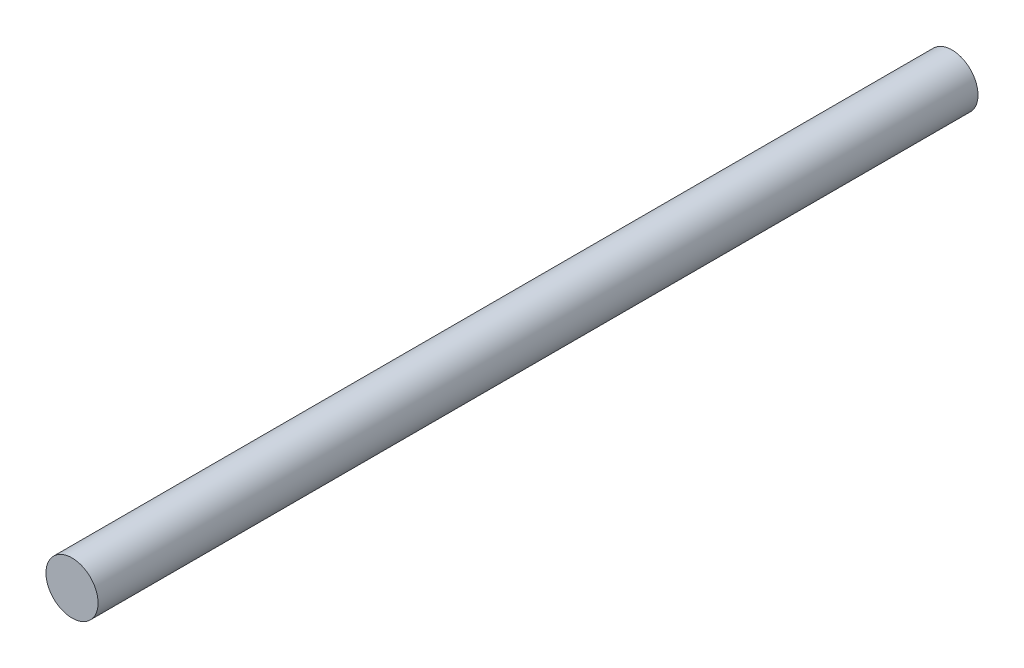
ISO-10303-21;
HEADER;
FILE_DESCRIPTION(('STEP AP214'),'2;1');
FILE_NAME('part.step','',(''),(''),'','','');
FILE_SCHEMA(('AUTOMOTIVE_DESIGN { 1 0 10303 214 1 1 1 1 }'));
ENDSEC;
DATA;
#1=APPLICATION_CONTEXT('core data for automotive mechanical design processes');
#2=APPLICATION_PROTOCOL_DEFINITION('international standard','automotive_design',2000,#1);
#3=PRODUCT_CONTEXT('',#1,'mechanical');
#4=PRODUCT('Part','Part','',(#3));
#5=PRODUCT_RELATED_PRODUCT_CATEGORY('part','',(#4));
#6=PRODUCT_DEFINITION_FORMATION('','',#4);
#7=PRODUCT_DEFINITION_CONTEXT('part definition',#1,'design');
#8=PRODUCT_DEFINITION('design','',#6,#7);
#9=PRODUCT_DEFINITION_SHAPE('','',#8);
#10=(LENGTH_UNIT() NAMED_UNIT(*) SI_UNIT(.MILLI.,.METRE.));
#11=(NAMED_UNIT(*) PLANE_ANGLE_UNIT() SI_UNIT($,.RADIAN.));
#12=(NAMED_UNIT(*) SI_UNIT($,.STERADIAN.) SOLID_ANGLE_UNIT());
#13=UNCERTAINTY_MEASURE_WITH_UNIT(LENGTH_MEASURE(1.E-05),#10,'distance_accuracy_value','');
#14=(GEOMETRIC_REPRESENTATION_CONTEXT(3) GLOBAL_UNCERTAINTY_ASSIGNED_CONTEXT((#13)) GLOBAL_UNIT_ASSIGNED_CONTEXT((#10,
#11,#12)) REPRESENTATION_CONTEXT('',''));
#15=CARTESIAN_POINT('',(0.,0.,0.));
#16=DIRECTION('',(0.,0.,1.));
#17=DIRECTION('',(1.,0.,0.));
#18=AXIS2_PLACEMENT_3D('',#15,#16,#17);
#19=CARTESIAN_POINT('',(0.,0.,422.));
#20=DIRECTION('',(0.,0.,-1.));
#21=DIRECTION('',(-1.,0.,0.));
#22=AXIS2_PLACEMENT_3D('',#19,#20,#21);
#23=CYLINDRICAL_SURFACE('',#22,12.5);
#24=CARTESIAN_POINT('',(0.,0.,422.));
#25=DIRECTION('',(0.,0.,1.));
#26=DIRECTION('',(1.,0.,0.));
#27=AXIS2_PLACEMENT_3D('',#24,#25,#26);
#28=CIRCLE('',#27,12.5);
#29=CARTESIAN_POINT('',(12.5,0.,422.));
#30=VERTEX_POINT('',#29);
#31=EDGE_CURVE('E10',#30,#30,#28,.T.);
#32=ORIENTED_EDGE('',*,*,#31,.F.);
#33=EDGE_LOOP('',(#32));
#34=FACE_BOUND('',#33,.T.);
#35=CARTESIAN_POINT('',(0.,0.,0.));
#36=DIRECTION('',(0.,0.,1.));
#37=DIRECTION('',(1.,0.,0.));
#38=AXIS2_PLACEMENT_3D('',#35,#36,#37);
#39=CIRCLE('',#38,12.5);
#40=CARTESIAN_POINT('',(12.5,0.,0.));
#41=VERTEX_POINT('',#40);
#42=EDGE_CURVE('E35',#41,#41,#39,.T.);
#43=ORIENTED_EDGE('',*,*,#42,.T.);
#44=EDGE_LOOP('',(#43));
#45=FACE_BOUND('',#44,.T.);
#46=ADVANCED_FACE('F32',(#34,#45),#23,.T.);
#47=CARTESIAN_POINT('',(0.,0.,422.));
#48=DIRECTION('',(0.,0.,1.));
#49=DIRECTION('',(1.,0.,0.));
#50=AXIS2_PLACEMENT_3D('',#47,#48,#49);
#51=PLANE('',#50);
#52=ORIENTED_EDGE('',*,*,#31,.T.);
#53=EDGE_LOOP('',(#52));
#54=FACE_BOUND('',#53,.T.);
#55=ADVANCED_FACE('F47',(#54),#51,.T.);
#56=CARTESIAN_POINT('',(0.,0.,0.));
#57=DIRECTION('',(0.,0.,1.));
#58=DIRECTION('',(1.,0.,0.));
#59=AXIS2_PLACEMENT_3D('',#56,#57,#58);
#60=PLANE('',#59);
#61=ORIENTED_EDGE('',*,*,#42,.F.);
#62=EDGE_LOOP('',(#61));
#63=FACE_BOUND('',#62,.T.);
#64=ADVANCED_FACE('F45',(#63),#60,.F.);
#65=CLOSED_SHELL('',(#46,#55,#64));
#66=MANIFOLD_SOLID_BREP('B2',#65);
#67=ADVANCED_BREP_SHAPE_REPRESENTATION('',(#18,#66),#14);
#68=SHAPE_DEFINITION_REPRESENTATION(#9,#67);
ENDSEC;
END-ISO-10303-21;
